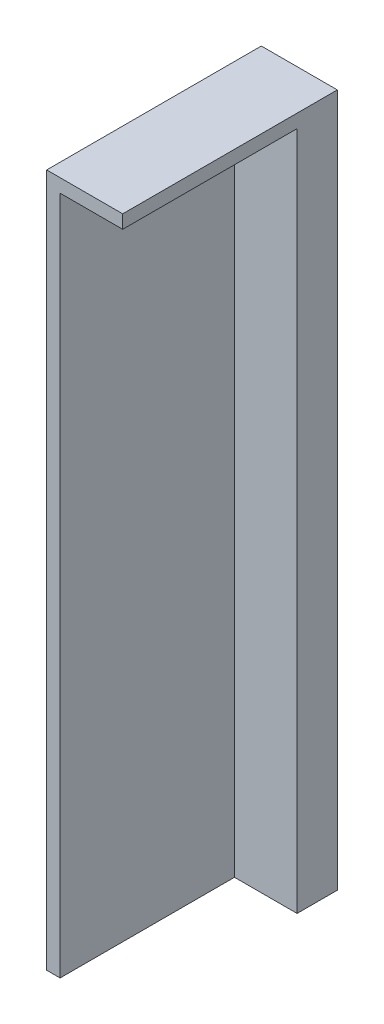
ISO-10303-21;
HEADER;
FILE_DESCRIPTION(('STEP AP214'),'2;1');
FILE_NAME('part.step','',(''),(''),'','','');
FILE_SCHEMA(('AUTOMOTIVE_DESIGN { 1 0 10303 214 1 1 1 1 }'));
ENDSEC;
DATA;
#1=APPLICATION_CONTEXT('core data for automotive mechanical design processes');
#2=APPLICATION_PROTOCOL_DEFINITION('international standard','automotive_design',2000,#1);
#3=PRODUCT_CONTEXT('',#1,'mechanical');
#4=PRODUCT('Part','Part','',(#3));
#5=PRODUCT_RELATED_PRODUCT_CATEGORY('part','',(#4));
#6=PRODUCT_DEFINITION_FORMATION('','',#4);
#7=PRODUCT_DEFINITION_CONTEXT('part definition',#1,'design');
#8=PRODUCT_DEFINITION('design','',#6,#7);
#9=PRODUCT_DEFINITION_SHAPE('','',#8);
#10=(LENGTH_UNIT() NAMED_UNIT(*) SI_UNIT(.MILLI.,.METRE.));
#11=(NAMED_UNIT(*) PLANE_ANGLE_UNIT() SI_UNIT($,.RADIAN.));
#12=(NAMED_UNIT(*) SI_UNIT($,.STERADIAN.) SOLID_ANGLE_UNIT());
#13=UNCERTAINTY_MEASURE_WITH_UNIT(LENGTH_MEASURE(1.E-05),#10,'distance_accuracy_value','');
#14=(GEOMETRIC_REPRESENTATION_CONTEXT(3) GLOBAL_UNCERTAINTY_ASSIGNED_CONTEXT((#13)) GLOBAL_UNIT_ASSIGNED_CONTEXT((#10,
#11,#12)) REPRESENTATION_CONTEXT('',''));
#15=CARTESIAN_POINT('',(0.,0.,0.));
#16=DIRECTION('',(0.,0.,1.));
#17=DIRECTION('',(1.,0.,0.));
#18=AXIS2_PLACEMENT_3D('',#15,#16,#17);
#19=CARTESIAN_POINT('',(-22.125,19.375,12.));
#20=DIRECTION('',(-1.,0.,0.));
#21=DIRECTION('',(0.,0.,-1.));
#22=AXIS2_PLACEMENT_3D('',#19,#20,#21);
#23=PLANE('',#22);
#24=DIRECTION('',(0.,0.,-1.));
#25=VECTOR('',#24,1.);
#26=CARTESIAN_POINT('',(-22.125,-19.375,12.));
#27=LINE('',#26,#25);
#28=CARTESIAN_POINT('',(-22.125,-19.375,2.25));
#29=VERTEX_POINT('',#28);
#30=CARTESIAN_POINT('',(-22.125,-19.375,0.));
#31=VERTEX_POINT('',#30);
#32=EDGE_CURVE('E11',#29,#31,#27,.T.);
#33=ORIENTED_EDGE('',*,*,#32,.T.);
#34=DIRECTION('',(0.,-1.,0.));
#35=VECTOR('',#34,1.);
#36=CARTESIAN_POINT('',(-22.125,19.375,0.));
#37=LINE('',#36,#35);
#38=CARTESIAN_POINT('',(-22.125,19.375,0.));
#39=VERTEX_POINT('',#38);
#40=EDGE_CURVE('E136',#39,#31,#37,.T.);
#41=ORIENTED_EDGE('',*,*,#40,.F.);
#42=DIRECTION('',(0.,0.,-1.));
#43=VECTOR('',#42,1.);
#44=CARTESIAN_POINT('',(-22.125,19.375,12.));
#45=LINE('',#44,#43);
#46=CARTESIAN_POINT('',(-22.125,19.375,12.));
#47=VERTEX_POINT('',#46);
#48=EDGE_CURVE('E135',#47,#39,#45,.T.);
#49=ORIENTED_EDGE('',*,*,#48,.F.);
#50=DIRECTION('',(0.,-1.,0.));
#51=VECTOR('',#50,1.);
#52=CARTESIAN_POINT('',(-22.125,19.375,12.));
#53=LINE('',#52,#51);
#54=CARTESIAN_POINT('',(-22.125,18.625,12.));
#55=VERTEX_POINT('',#54);
#56=EDGE_CURVE('E130',#47,#55,#53,.T.);
#57=ORIENTED_EDGE('',*,*,#56,.T.);
#58=DIRECTION('',(0.,0.,-1.));
#59=VECTOR('',#58,1.);
#60=CARTESIAN_POINT('',(-22.125,18.625,12.));
#61=LINE('',#60,#59);
#62=CARTESIAN_POINT('',(-22.125,18.625,2.25));
#63=VERTEX_POINT('',#62);
#64=EDGE_CURVE('E120',#55,#63,#61,.T.);
#65=ORIENTED_EDGE('',*,*,#64,.T.);
#66=DIRECTION('',(0.,-1.,0.));
#67=VECTOR('',#66,1.);
#68=CARTESIAN_POINT('',(-22.125,-19.375,2.25));
#69=LINE('',#68,#67);
#70=EDGE_CURVE('E116',#63,#29,#69,.T.);
#71=ORIENTED_EDGE('',*,*,#70,.T.);
#72=EDGE_LOOP('',(#33,#41,#49,#57,#65,#71));
#73=FACE_BOUND('',#72,.T.);
#74=ADVANCED_FACE('F37',(#73),#23,.F.);
#75=CARTESIAN_POINT('',(-22.125,-19.375,12.));
#76=DIRECTION('',(0.,1.,0.));
#77=DIRECTION('',(0.,0.,1.));
#78=AXIS2_PLACEMENT_3D('',#75,#76,#77);
#79=PLANE('',#78);
#80=DIRECTION('',(0.,0.,1.));
#81=VECTOR('',#80,1.);
#82=CARTESIAN_POINT('',(-25.625,-19.375,12.));
#83=LINE('',#82,#81);
#84=CARTESIAN_POINT('',(-25.625,-19.375,2.25));
#85=VERTEX_POINT('',#84);
#86=CARTESIAN_POINT('',(-25.625,-19.375,12.));
#87=VERTEX_POINT('',#86);
#88=EDGE_CURVE('E123',#85,#87,#83,.T.);
#89=ORIENTED_EDGE('',*,*,#88,.T.);
#90=DIRECTION('',(-1.,0.,0.));
#91=VECTOR('',#90,1.);
#92=CARTESIAN_POINT('',(-22.125,-19.375,12.));
#93=LINE('',#92,#91);
#94=CARTESIAN_POINT('',(-26.375,-19.375,12.));
#95=VERTEX_POINT('',#94);
#96=EDGE_CURVE('E114',#87,#95,#93,.T.);
#97=ORIENTED_EDGE('',*,*,#96,.T.);
#98=DIRECTION('',(0.,0.,-1.));
#99=VECTOR('',#98,1.);
#100=CARTESIAN_POINT('',(-26.375,-19.375,12.));
#101=LINE('',#100,#99);
#102=CARTESIAN_POINT('',(-26.375,-19.375,0.));
#103=VERTEX_POINT('',#102);
#104=EDGE_CURVE('E44',#95,#103,#101,.T.);
#105=ORIENTED_EDGE('',*,*,#104,.T.);
#106=DIRECTION('',(-1.,0.,0.));
#107=VECTOR('',#106,1.);
#108=CARTESIAN_POINT('',(-22.125,-19.375,0.));
#109=LINE('',#108,#107);
#110=EDGE_CURVE('E138',#31,#103,#109,.T.);
#111=ORIENTED_EDGE('',*,*,#110,.F.);
#112=ORIENTED_EDGE('',*,*,#32,.F.);
#113=DIRECTION('',(1.,0.,0.));
#114=VECTOR('',#113,1.);
#115=CARTESIAN_POINT('',(-25.625,-19.375,2.25));
#116=LINE('',#115,#114);
#117=EDGE_CURVE('E125',#85,#29,#116,.T.);
#118=ORIENTED_EDGE('',*,*,#117,.F.);
#119=EDGE_LOOP('',(#89,#97,#105,#111,#112,#118));
#120=FACE_BOUND('',#119,.T.);
#121=ADVANCED_FACE('F149',(#120),#79,.F.);
#122=CARTESIAN_POINT('',(-26.375,19.375,12.));
#123=DIRECTION('',(1.,0.,0.));
#124=DIRECTION('',(0.,-1.,0.));
#125=AXIS2_PLACEMENT_3D('',#122,#123,#124);
#126=PLANE('',#125);
#127=DIRECTION('',(0.,1.,0.));
#128=VECTOR('',#127,1.);
#129=CARTESIAN_POINT('',(-26.375,19.375,0.));
#130=LINE('',#129,#128);
#131=CARTESIAN_POINT('',(-26.375,19.375,0.));
#132=VERTEX_POINT('',#131);
#133=EDGE_CURVE('E141',#103,#132,#130,.T.);
#134=ORIENTED_EDGE('',*,*,#133,.F.);
#135=ORIENTED_EDGE('',*,*,#104,.F.);
#136=DIRECTION('',(0.,1.,0.));
#137=VECTOR('',#136,1.);
#138=CARTESIAN_POINT('',(-26.375,19.375,12.));
#139=LINE('',#138,#137);
#140=CARTESIAN_POINT('',(-26.375,19.375,12.));
#141=VERTEX_POINT('',#140);
#142=EDGE_CURVE('E84',#95,#141,#139,.T.);
#143=ORIENTED_EDGE('',*,*,#142,.T.);
#144=DIRECTION('',(0.,0.,-1.));
#145=VECTOR('',#144,1.);
#146=CARTESIAN_POINT('',(-26.375,19.375,12.));
#147=LINE('',#146,#145);
#148=EDGE_CURVE('E145',#141,#132,#147,.T.);
#149=ORIENTED_EDGE('',*,*,#148,.T.);
#150=EDGE_LOOP('',(#134,#135,#143,#149));
#151=FACE_BOUND('',#150,.T.);
#152=ADVANCED_FACE('F152',(#151),#126,.F.);
#153=CARTESIAN_POINT('',(-22.125,19.375,12.));
#154=DIRECTION('',(0.,-1.,0.));
#155=DIRECTION('',(0.,0.,-1.));
#156=AXIS2_PLACEMENT_3D('',#153,#154,#155);
#157=PLANE('',#156);
#158=DIRECTION('',(1.,0.,0.));
#159=VECTOR('',#158,1.);
#160=CARTESIAN_POINT('',(-22.125,19.375,0.));
#161=LINE('',#160,#159);
#162=EDGE_CURVE('E80',#132,#39,#161,.T.);
#163=ORIENTED_EDGE('',*,*,#162,.F.);
#164=ORIENTED_EDGE('',*,*,#148,.F.);
#165=DIRECTION('',(1.,0.,0.));
#166=VECTOR('',#165,1.);
#167=CARTESIAN_POINT('',(-22.125,19.375,12.));
#168=LINE('',#167,#166);
#169=EDGE_CURVE('E60',#141,#47,#168,.T.);
#170=ORIENTED_EDGE('',*,*,#169,.T.);
#171=ORIENTED_EDGE('',*,*,#48,.T.);
#172=EDGE_LOOP('',(#163,#164,#170,#171));
#173=FACE_BOUND('',#172,.T.);
#174=ADVANCED_FACE('F165',(#173),#157,.F.);
#175=CARTESIAN_POINT('',(-24.25,0.,12.));
#176=DIRECTION('',(0.,0.,1.));
#177=DIRECTION('',(-1.,0.,0.));
#178=AXIS2_PLACEMENT_3D('',#175,#176,#177);
#179=PLANE('',#178);
#180=DIRECTION('',(1.,0.,0.));
#181=VECTOR('',#180,1.);
#182=CARTESIAN_POINT('',(-25.625,18.625,12.));
#183=LINE('',#182,#181);
#184=CARTESIAN_POINT('',(-25.625,18.625,12.));
#185=VERTEX_POINT('',#184);
#186=EDGE_CURVE('E111',#185,#55,#183,.T.);
#187=ORIENTED_EDGE('',*,*,#186,.T.);
#188=ORIENTED_EDGE('',*,*,#56,.F.);
#189=ORIENTED_EDGE('',*,*,#169,.F.);
#190=ORIENTED_EDGE('',*,*,#142,.F.);
#191=ORIENTED_EDGE('',*,*,#96,.F.);
#192=DIRECTION('',(0.,1.,0.));
#193=VECTOR('',#192,1.);
#194=CARTESIAN_POINT('',(-25.625,-19.375,12.));
#195=LINE('',#194,#193);
#196=EDGE_CURVE('E51',#87,#185,#195,.T.);
#197=ORIENTED_EDGE('',*,*,#196,.T.);
#198=EDGE_LOOP('',(#187,#188,#189,#190,#191,#197));
#199=FACE_BOUND('',#198,.T.);
#200=ADVANCED_FACE('F110',(#199),#179,.T.);
#201=CARTESIAN_POINT('',(-24.25,0.,0.));
#202=DIRECTION('',(0.,0.,1.));
#203=DIRECTION('',(-1.,0.,0.));
#204=AXIS2_PLACEMENT_3D('',#201,#202,#203);
#205=PLANE('',#204);
#206=ORIENTED_EDGE('',*,*,#40,.T.);
#207=ORIENTED_EDGE('',*,*,#110,.T.);
#208=ORIENTED_EDGE('',*,*,#133,.T.);
#209=ORIENTED_EDGE('',*,*,#162,.T.);
#210=EDGE_LOOP('',(#206,#207,#208,#209));
#211=FACE_BOUND('',#210,.T.);
#212=ADVANCED_FACE('F153',(#211),#205,.F.);
#213=CARTESIAN_POINT('',(-25.625,-19.375,2.25));
#214=DIRECTION('',(0.,0.,-1.));
#215=DIRECTION('',(1.,0.,0.));
#216=AXIS2_PLACEMENT_3D('',#213,#214,#215);
#217=PLANE('',#216);
#218=ORIENTED_EDGE('',*,*,#70,.F.);
#219=DIRECTION('',(1.,0.,0.));
#220=VECTOR('',#219,1.);
#221=CARTESIAN_POINT('',(-25.625,18.625,2.25));
#222=LINE('',#221,#220);
#223=CARTESIAN_POINT('',(-25.625,18.625,2.25));
#224=VERTEX_POINT('',#223);
#225=EDGE_CURVE('E122',#224,#63,#222,.T.);
#226=ORIENTED_EDGE('',*,*,#225,.F.);
#227=DIRECTION('',(0.,-1.,0.));
#228=VECTOR('',#227,1.);
#229=CARTESIAN_POINT('',(-25.625,-19.375,2.25));
#230=LINE('',#229,#228);
#231=EDGE_CURVE('E105',#224,#85,#230,.T.);
#232=ORIENTED_EDGE('',*,*,#231,.T.);
#233=ORIENTED_EDGE('',*,*,#117,.T.);
#234=EDGE_LOOP('',(#218,#226,#232,#233));
#235=FACE_BOUND('',#234,.T.);
#236=ADVANCED_FACE('F164',(#235),#217,.F.);
#237=CARTESIAN_POINT('',(-25.625,18.625,12.));
#238=DIRECTION('',(0.,1.,0.));
#239=DIRECTION('',(0.,0.,1.));
#240=AXIS2_PLACEMENT_3D('',#237,#238,#239);
#241=PLANE('',#240);
#242=ORIENTED_EDGE('',*,*,#64,.F.);
#243=ORIENTED_EDGE('',*,*,#186,.F.);
#244=DIRECTION('',(0.,0.,-1.));
#245=VECTOR('',#244,1.);
#246=CARTESIAN_POINT('',(-25.625,18.625,12.));
#247=LINE('',#246,#245);
#248=EDGE_CURVE('E103',#185,#224,#247,.T.);
#249=ORIENTED_EDGE('',*,*,#248,.T.);
#250=ORIENTED_EDGE('',*,*,#225,.T.);
#251=EDGE_LOOP('',(#242,#243,#249,#250));
#252=FACE_BOUND('',#251,.T.);
#253=ADVANCED_FACE('F118',(#252),#241,.F.);
#254=CARTESIAN_POINT('',(-25.625,0.,0.));
#255=DIRECTION('',(1.,0.,0.));
#256=DIRECTION('',(0.,0.,1.));
#257=AXIS2_PLACEMENT_3D('',#254,#255,#256);
#258=PLANE('',#257);
#259=ORIENTED_EDGE('',*,*,#196,.F.);
#260=ORIENTED_EDGE('',*,*,#88,.F.);
#261=ORIENTED_EDGE('',*,*,#231,.F.);
#262=ORIENTED_EDGE('',*,*,#248,.F.);
#263=EDGE_LOOP('',(#259,#260,#261,#262));
#264=FACE_BOUND('',#263,.T.);
#265=ADVANCED_FACE('F104',(#264),#258,.T.);
#266=CLOSED_SHELL('',(#74,#121,#152,#174,#200,#212,#236,#253,#265));
#267=MANIFOLD_SOLID_BREP('B2',#266);
#268=ADVANCED_BREP_SHAPE_REPRESENTATION('',(#18,#267),#14);
#269=SHAPE_DEFINITION_REPRESENTATION(#9,#268);
ENDSEC;
END-ISO-10303-21;
